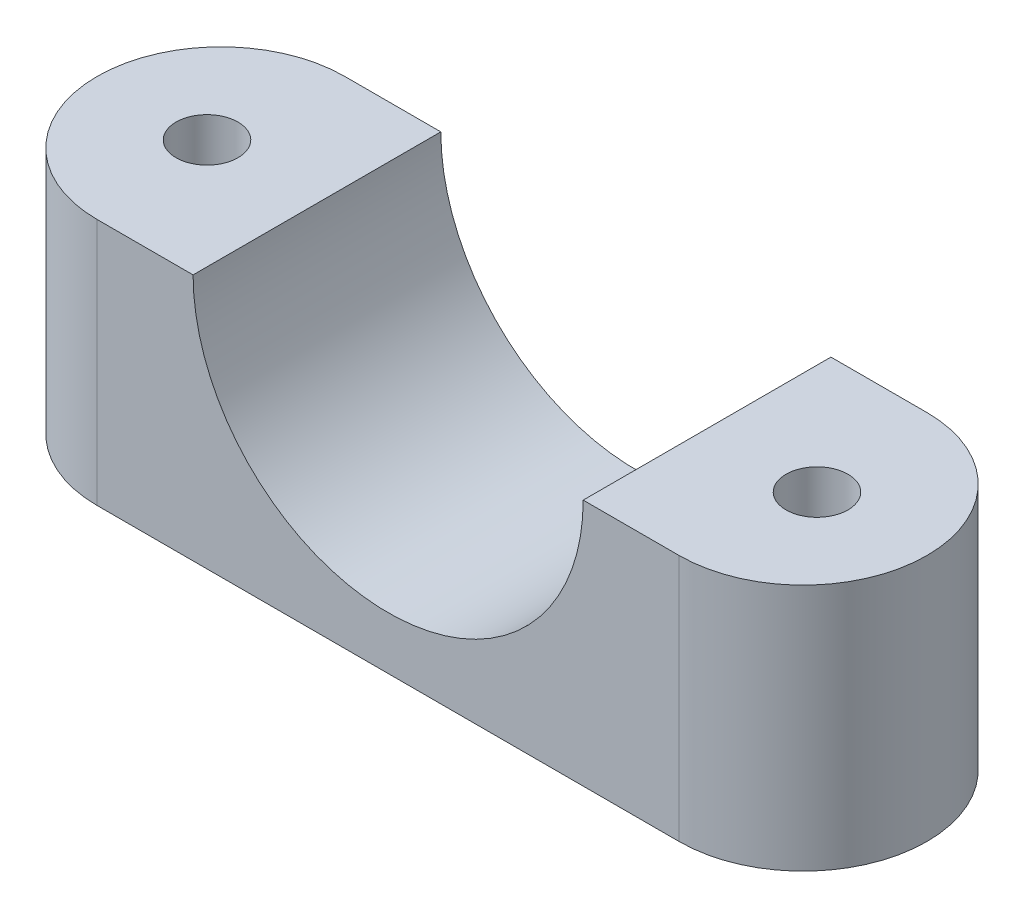
ISO-10303-21;
HEADER;
FILE_DESCRIPTION(('STEP AP214'),'2;1');
FILE_NAME('part.step','',(''),(''),'','','');
FILE_SCHEMA(('AUTOMOTIVE_DESIGN { 1 0 10303 214 1 1 1 1 }'));
ENDSEC;
DATA;
#1=APPLICATION_CONTEXT('core data for automotive mechanical design processes');
#2=APPLICATION_PROTOCOL_DEFINITION('international standard','automotive_design',2000,#1);
#3=PRODUCT_CONTEXT('',#1,'mechanical');
#4=PRODUCT('Part','Part','',(#3));
#5=PRODUCT_RELATED_PRODUCT_CATEGORY('part','',(#4));
#6=PRODUCT_DEFINITION_FORMATION('','',#4);
#7=PRODUCT_DEFINITION_CONTEXT('part definition',#1,'design');
#8=PRODUCT_DEFINITION('design','',#6,#7);
#9=PRODUCT_DEFINITION_SHAPE('','',#8);
#10=(LENGTH_UNIT() NAMED_UNIT(*) SI_UNIT(.MILLI.,.METRE.));
#11=(NAMED_UNIT(*) PLANE_ANGLE_UNIT() SI_UNIT($,.RADIAN.));
#12=(NAMED_UNIT(*) SI_UNIT($,.STERADIAN.) SOLID_ANGLE_UNIT());
#13=UNCERTAINTY_MEASURE_WITH_UNIT(LENGTH_MEASURE(1.E-05),#10,'distance_accuracy_value','');
#14=(GEOMETRIC_REPRESENTATION_CONTEXT(3) GLOBAL_UNCERTAINTY_ASSIGNED_CONTEXT((#13)) GLOBAL_UNIT_ASSIGNED_CONTEXT((#10,
#11,#12)) REPRESENTATION_CONTEXT('',''));
#15=CARTESIAN_POINT('',(0.,0.,0.));
#16=DIRECTION('',(0.,0.,1.));
#17=DIRECTION('',(1.,0.,0.));
#18=AXIS2_PLACEMENT_3D('',#15,#16,#17);
#19=CARTESIAN_POINT('',(-42.545,-25.4,12.7));
#20=DIRECTION('',(0.,1.,0.));
#21=DIRECTION('',(0.,0.,1.));
#22=AXIS2_PLACEMENT_3D('',#19,#20,#21);
#23=PLANE('',#22);
#24=CARTESIAN_POINT('',(-31.2725,-25.4,0.));
#25=DIRECTION('',(0.,1.,0.));
#26=DIRECTION('',(-1.,0.,0.));
#27=AXIS2_PLACEMENT_3D('',#24,#25,#26);
#28=CIRCLE('',#27,3.175);
#29=CARTESIAN_POINT('',(-34.4475,-25.4,0.));
#30=VERTEX_POINT('',#29);
#31=EDGE_CURVE('E123',#30,#30,#28,.T.);
#32=ORIENTED_EDGE('',*,*,#31,.T.);
#33=EDGE_LOOP('',(#32));
#34=FACE_BOUND('',#33,.T.);
#35=CARTESIAN_POINT('',(31.2725,-25.4000000000001,0.));
#36=DIRECTION('',(0.,-1.,0.));
#37=DIRECTION('',(1.,0.,0.));
#38=AXIS2_PLACEMENT_3D('',#35,#36,#37);
#39=CIRCLE('',#38,3.175);
#40=CARTESIAN_POINT('',(34.4475,-25.4000000000001,0.));
#41=VERTEX_POINT('',#40);
#42=EDGE_CURVE('E137',#41,#41,#39,.T.);
#43=ORIENTED_EDGE('',*,*,#42,.F.);
#44=EDGE_LOOP('',(#43));
#45=FACE_BOUND('',#44,.T.);
#46=CARTESIAN_POINT('',(-29.845,-25.4,0.));
#47=DIRECTION('',(0.,-1.,0.));
#48=DIRECTION('',(0.,0.,-1.));
#49=AXIS2_PLACEMENT_3D('',#46,#47,#48);
#50=CIRCLE('',#49,12.7);
#51=CARTESIAN_POINT('',(-29.845,-25.4,12.7));
#52=VERTEX_POINT('',#51);
#53=CARTESIAN_POINT('',(-29.845,-25.4,-12.7));
#54=VERTEX_POINT('',#53);
#55=EDGE_CURVE('E149',#52,#54,#50,.T.);
#56=ORIENTED_EDGE('',*,*,#55,.T.);
#57=DIRECTION('',(1.,0.,0.));
#58=VECTOR('',#57,1.);
#59=CARTESIAN_POINT('',(-42.545,-25.4,-12.7));
#60=LINE('',#59,#58);
#61=CARTESIAN_POINT('',(29.845,-25.4,-12.7));
#62=VERTEX_POINT('',#61);
#63=EDGE_CURVE('E126',#54,#62,#60,.T.);
#64=ORIENTED_EDGE('',*,*,#63,.T.);
#65=CARTESIAN_POINT('',(29.845,-25.4,0.));
#66=DIRECTION('',(0.,-1.,0.));
#67=DIRECTION('',(0.,0.,1.));
#68=AXIS2_PLACEMENT_3D('',#65,#66,#67);
#69=CIRCLE('',#68,12.7);
#70=CARTESIAN_POINT('',(29.845,-25.4,12.7));
#71=VERTEX_POINT('',#70);
#72=EDGE_CURVE('E60',#62,#71,#69,.T.);
#73=ORIENTED_EDGE('',*,*,#72,.T.);
#74=DIRECTION('',(1.,0.,0.));
#75=VECTOR('',#74,1.);
#76=CARTESIAN_POINT('',(-42.545,-25.4,12.7));
#77=LINE('',#76,#75);
#78=EDGE_CURVE('E108',#52,#71,#77,.T.);
#79=ORIENTED_EDGE('',*,*,#78,.F.);
#80=EDGE_LOOP('',(#56,#64,#73,#79));
#81=FACE_BOUND('',#80,.T.);
#82=ADVANCED_FACE('F37',(#34,#45,#81),#23,.F.);
#83=CARTESIAN_POINT('',(20.,0.,12.7));
#84=DIRECTION('',(0.,-1.,0.));
#85=DIRECTION('',(1.,0.,0.));
#86=AXIS2_PLACEMENT_3D('',#83,#84,#85);
#87=PLANE('',#86);
#88=CARTESIAN_POINT('',(31.2725,0.,0.));
#89=DIRECTION('',(0.,-1.,0.));
#90=DIRECTION('',(1.,0.,0.));
#91=AXIS2_PLACEMENT_3D('',#88,#89,#90);
#92=CIRCLE('',#91,3.175);
#93=CARTESIAN_POINT('',(34.4475,0.,0.));
#94=VERTEX_POINT('',#93);
#95=EDGE_CURVE('E140',#94,#94,#92,.T.);
#96=ORIENTED_EDGE('',*,*,#95,.T.);
#97=EDGE_LOOP('',(#96));
#98=FACE_BOUND('',#97,.T.);
#99=DIRECTION('',(-1.,0.,0.));
#100=VECTOR('',#99,1.);
#101=CARTESIAN_POINT('',(20.,0.,12.7));
#102=LINE('',#101,#100);
#103=CARTESIAN_POINT('',(29.845,0.,12.7));
#104=VERTEX_POINT('',#103);
#105=CARTESIAN_POINT('',(20.,0.,12.7));
#106=VERTEX_POINT('',#105);
#107=EDGE_CURVE('E104',#104,#106,#102,.T.);
#108=ORIENTED_EDGE('',*,*,#107,.F.);
#109=CARTESIAN_POINT('',(29.845,0.,0.));
#110=DIRECTION('',(0.,-1.,0.));
#111=DIRECTION('',(0.,0.,1.));
#112=AXIS2_PLACEMENT_3D('',#109,#110,#111);
#113=CIRCLE('',#112,12.7);
#114=CARTESIAN_POINT('',(29.845,0.,-12.7));
#115=VERTEX_POINT('',#114);
#116=EDGE_CURVE('E89',#115,#104,#113,.T.);
#117=ORIENTED_EDGE('',*,*,#116,.F.);
#118=DIRECTION('',(-1.,0.,0.));
#119=VECTOR('',#118,1.);
#120=CARTESIAN_POINT('',(20.,0.,-12.7));
#121=LINE('',#120,#119);
#122=CARTESIAN_POINT('',(20.,0.,-12.7));
#123=VERTEX_POINT('',#122);
#124=EDGE_CURVE('E129',#115,#123,#121,.T.);
#125=ORIENTED_EDGE('',*,*,#124,.T.);
#126=DIRECTION('',(0.,0.,-1.));
#127=VECTOR('',#126,1.);
#128=CARTESIAN_POINT('',(20.,0.,12.7));
#129=LINE('',#128,#127);
#130=EDGE_CURVE('E45',#106,#123,#129,.T.);
#131=ORIENTED_EDGE('',*,*,#130,.F.);
#132=EDGE_LOOP('',(#108,#117,#125,#131));
#133=FACE_BOUND('',#132,.T.);
#134=ADVANCED_FACE('F111',(#98,#133),#87,.F.);
#135=CARTESIAN_POINT('',(-20.,0.,12.7));
#136=DIRECTION('',(0.,-1.,0.));
#137=DIRECTION('',(1.,0.,0.));
#138=AXIS2_PLACEMENT_3D('',#135,#136,#137);
#139=PLANE('',#138);
#140=CARTESIAN_POINT('',(-31.2725,0.,0.));
#141=DIRECTION('',(0.,1.,0.));
#142=DIRECTION('',(-1.,0.,0.));
#143=AXIS2_PLACEMENT_3D('',#140,#141,#142);
#144=CIRCLE('',#143,3.175);
#145=CARTESIAN_POINT('',(-34.4475,0.,0.));
#146=VERTEX_POINT('',#145);
#147=EDGE_CURVE('E134',#146,#146,#144,.T.);
#148=ORIENTED_EDGE('',*,*,#147,.F.);
#149=EDGE_LOOP('',(#148));
#150=FACE_BOUND('',#149,.T.);
#151=CARTESIAN_POINT('',(-29.845,0.,0.));
#152=DIRECTION('',(0.,-1.,0.));
#153=DIRECTION('',(0.,0.,-1.));
#154=AXIS2_PLACEMENT_3D('',#151,#152,#153);
#155=CIRCLE('',#154,12.7);
#156=CARTESIAN_POINT('',(-29.845,0.,12.7));
#157=VERTEX_POINT('',#156);
#158=CARTESIAN_POINT('',(-29.845,0.,-12.7));
#159=VERTEX_POINT('',#158);
#160=EDGE_CURVE('E52',#157,#159,#155,.T.);
#161=ORIENTED_EDGE('',*,*,#160,.F.);
#162=DIRECTION('',(-1.,0.,0.));
#163=VECTOR('',#162,1.);
#164=CARTESIAN_POINT('',(-20.,0.,12.7));
#165=LINE('',#164,#163);
#166=CARTESIAN_POINT('',(-20.,0.,12.7));
#167=VERTEX_POINT('',#166);
#168=EDGE_CURVE('E115',#167,#157,#165,.T.);
#169=ORIENTED_EDGE('',*,*,#168,.F.);
#170=DIRECTION('',(0.,0.,-1.));
#171=VECTOR('',#170,1.);
#172=CARTESIAN_POINT('',(-20.,0.,12.7));
#173=LINE('',#172,#171);
#174=CARTESIAN_POINT('',(-20.,0.,-12.7));
#175=VERTEX_POINT('',#174);
#176=EDGE_CURVE('E12',#167,#175,#173,.T.);
#177=ORIENTED_EDGE('',*,*,#176,.T.);
#178=DIRECTION('',(-1.,0.,0.));
#179=VECTOR('',#178,1.);
#180=CARTESIAN_POINT('',(-20.,0.,-12.7));
#181=LINE('',#180,#179);
#182=EDGE_CURVE('E122',#175,#159,#181,.T.);
#183=ORIENTED_EDGE('',*,*,#182,.T.);
#184=EDGE_LOOP('',(#161,#169,#177,#183));
#185=FACE_BOUND('',#184,.T.);
#186=ADVANCED_FACE('F159',(#150,#185),#139,.F.);
#187=CARTESIAN_POINT('',(0.,0.,12.7));
#188=DIRECTION('',(0.,0.,1.));
#189=DIRECTION('',(1.,0.,0.));
#190=AXIS2_PLACEMENT_3D('',#187,#188,#189);
#191=PLANE('',#190);
#192=ORIENTED_EDGE('',*,*,#168,.T.);
#193=DIRECTION('',(0.,-1.,0.));
#194=VECTOR('',#193,1.);
#195=CARTESIAN_POINT('',(-29.845,0.,12.7));
#196=LINE('',#195,#194);
#197=EDGE_CURVE('E109',#157,#52,#196,.T.);
#198=ORIENTED_EDGE('',*,*,#197,.T.);
#199=ORIENTED_EDGE('',*,*,#78,.T.);
#200=DIRECTION('',(0.,-1.,0.));
#201=VECTOR('',#200,1.);
#202=CARTESIAN_POINT('',(29.845,0.,12.7));
#203=LINE('',#202,#201);
#204=EDGE_CURVE('E92',#104,#71,#203,.T.);
#205=ORIENTED_EDGE('',*,*,#204,.F.);
#206=ORIENTED_EDGE('',*,*,#107,.T.);
#207=CARTESIAN_POINT('',(0.,0.,12.7));
#208=DIRECTION('',(0.,0.,-1.));
#209=DIRECTION('',(1.,0.,0.));
#210=AXIS2_PLACEMENT_3D('',#207,#208,#209);
#211=CIRCLE('',#210,20.);
#212=EDGE_CURVE('E130',#106,#167,#211,.T.);
#213=ORIENTED_EDGE('',*,*,#212,.T.);
#214=EDGE_LOOP('',(#192,#198,#199,#205,#206,#213));
#215=FACE_BOUND('',#214,.T.);
#216=ADVANCED_FACE('F102',(#215),#191,.T.);
#217=CARTESIAN_POINT('',(0.,0.,-12.7));
#218=DIRECTION('',(0.,0.,1.));
#219=DIRECTION('',(1.,0.,0.));
#220=AXIS2_PLACEMENT_3D('',#217,#218,#219);
#221=PLANE('',#220);
#222=DIRECTION('',(0.,-1.,0.));
#223=VECTOR('',#222,1.);
#224=CARTESIAN_POINT('',(-29.845,0.,-12.7));
#225=LINE('',#224,#223);
#226=EDGE_CURVE('E98',#159,#54,#225,.T.);
#227=ORIENTED_EDGE('',*,*,#226,.F.);
#228=ORIENTED_EDGE('',*,*,#182,.F.);
#229=CARTESIAN_POINT('',(0.,0.,-12.7));
#230=DIRECTION('',(0.,0.,-1.));
#231=DIRECTION('',(1.,0.,0.));
#232=AXIS2_PLACEMENT_3D('',#229,#230,#231);
#233=CIRCLE('',#232,20.);
#234=EDGE_CURVE('E119',#123,#175,#233,.T.);
#235=ORIENTED_EDGE('',*,*,#234,.F.);
#236=ORIENTED_EDGE('',*,*,#124,.F.);
#237=DIRECTION('',(0.,-1.,0.));
#238=VECTOR('',#237,1.);
#239=CARTESIAN_POINT('',(29.845,0.,-12.7));
#240=LINE('',#239,#238);
#241=EDGE_CURVE('E94',#115,#62,#240,.T.);
#242=ORIENTED_EDGE('',*,*,#241,.T.);
#243=ORIENTED_EDGE('',*,*,#63,.F.);
#244=EDGE_LOOP('',(#227,#228,#235,#236,#242,#243));
#245=FACE_BOUND('',#244,.T.);
#246=ADVANCED_FACE('F155',(#245),#221,.F.);
#247=CARTESIAN_POINT('',(0.,0.,12.7));
#248=DIRECTION('',(0.,0.,-1.));
#249=DIRECTION('',(-1.,0.,0.));
#250=AXIS2_PLACEMENT_3D('',#247,#248,#249);
#251=CYLINDRICAL_SURFACE('',#250,20.);
#252=ORIENTED_EDGE('',*,*,#234,.T.);
#253=ORIENTED_EDGE('',*,*,#176,.F.);
#254=ORIENTED_EDGE('',*,*,#212,.F.);
#255=ORIENTED_EDGE('',*,*,#130,.T.);
#256=EDGE_LOOP('',(#252,#253,#254,#255));
#257=FACE_BOUND('',#256,.T.);
#258=ADVANCED_FACE('F39',(#257),#251,.F.);
#259=CARTESIAN_POINT('',(-31.2725,-25.4,0.));
#260=DIRECTION('',(0.,1.,0.));
#261=DIRECTION('',(-1.,0.,0.));
#262=AXIS2_PLACEMENT_3D('',#259,#260,#261);
#263=CYLINDRICAL_SURFACE('',#262,3.175);
#264=ORIENTED_EDGE('',*,*,#31,.F.);
#265=EDGE_LOOP('',(#264));
#266=FACE_BOUND('',#265,.T.);
#267=ORIENTED_EDGE('',*,*,#147,.T.);
#268=EDGE_LOOP('',(#267));
#269=FACE_BOUND('',#268,.T.);
#270=ADVANCED_FACE('F179',(#266,#269),#263,.F.);
#271=CARTESIAN_POINT('',(31.2725,-25.4000000000001,0.));
#272=DIRECTION('',(0.,1.,0.));
#273=DIRECTION('',(-1.,0.,0.));
#274=AXIS2_PLACEMENT_3D('',#271,#272,#273);
#275=CYLINDRICAL_SURFACE('',#274,3.175);
#276=ORIENTED_EDGE('',*,*,#42,.T.);
#277=EDGE_LOOP('',(#276));
#278=FACE_BOUND('',#277,.T.);
#279=ORIENTED_EDGE('',*,*,#95,.F.);
#280=EDGE_LOOP('',(#279));
#281=FACE_BOUND('',#280,.T.);
#282=ADVANCED_FACE('F182',(#278,#281),#275,.F.);
#283=CARTESIAN_POINT('',(29.845,0.,0.));
#284=DIRECTION('',(0.,-1.,0.));
#285=DIRECTION('',(0.,0.,-1.));
#286=AXIS2_PLACEMENT_3D('',#283,#284,#285);
#287=CYLINDRICAL_SURFACE('',#286,12.7);
#288=ORIENTED_EDGE('',*,*,#116,.T.);
#289=ORIENTED_EDGE('',*,*,#204,.T.);
#290=ORIENTED_EDGE('',*,*,#72,.F.);
#291=ORIENTED_EDGE('',*,*,#241,.F.);
#292=EDGE_LOOP('',(#288,#289,#290,#291));
#293=FACE_BOUND('',#292,.T.);
#294=ADVANCED_FACE('F91',(#293),#287,.T.);
#295=CARTESIAN_POINT('',(-29.845,0.,0.));
#296=DIRECTION('',(0.,-1.,0.));
#297=DIRECTION('',(0.,0.,-1.));
#298=AXIS2_PLACEMENT_3D('',#295,#296,#297);
#299=CYLINDRICAL_SURFACE('',#298,12.7);
#300=ORIENTED_EDGE('',*,*,#197,.F.);
#301=ORIENTED_EDGE('',*,*,#160,.T.);
#302=ORIENTED_EDGE('',*,*,#226,.T.);
#303=ORIENTED_EDGE('',*,*,#55,.F.);
#304=EDGE_LOOP('',(#300,#301,#302,#303));
#305=FACE_BOUND('',#304,.T.);
#306=ADVANCED_FACE('F153',(#305),#299,.T.);
#307=CLOSED_SHELL('',(#82,#134,#186,#216,#246,#258,#270,#282,#294,#306));
#308=MANIFOLD_SOLID_BREP('B2',#307);
#309=ADVANCED_BREP_SHAPE_REPRESENTATION('',(#18,#308),#14);
#310=SHAPE_DEFINITION_REPRESENTATION(#9,#309);
ENDSEC;
END-ISO-10303-21;
